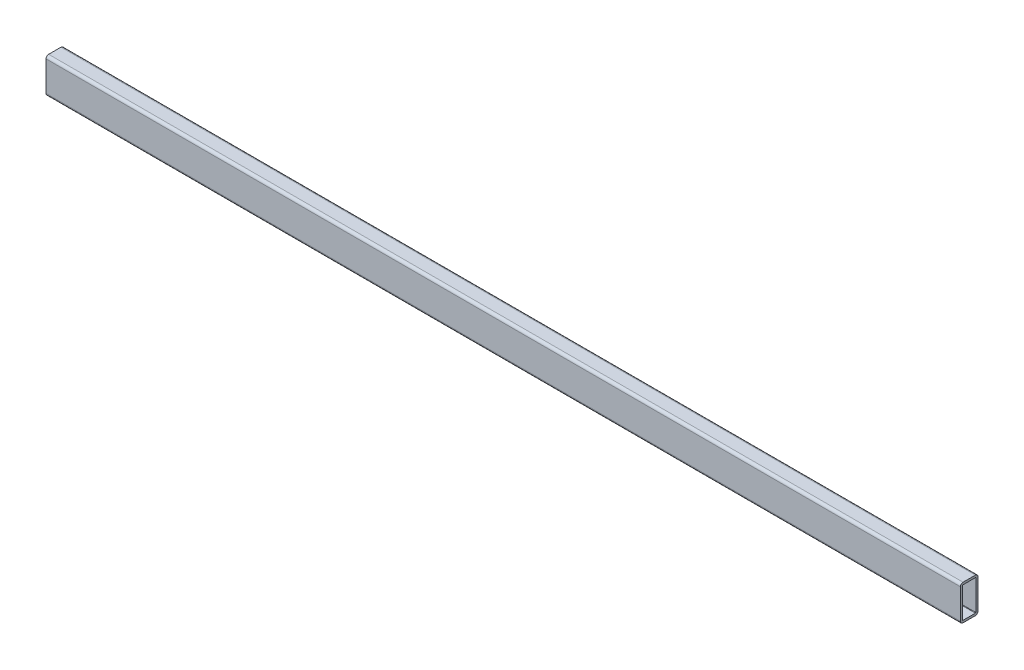
ISO-10303-21;
HEADER;
FILE_DESCRIPTION(('STEP AP214'),'2;1');
FILE_NAME('part.step','',(''),(''),'','','');
FILE_SCHEMA(('AUTOMOTIVE_DESIGN { 1 0 10303 214 1 1 1 1 }'));
ENDSEC;
DATA;
#1=APPLICATION_CONTEXT('core data for automotive mechanical design processes');
#2=APPLICATION_PROTOCOL_DEFINITION('international standard','automotive_design',2000,#1);
#3=PRODUCT_CONTEXT('',#1,'mechanical');
#4=PRODUCT('Part','Part','',(#3));
#5=PRODUCT_RELATED_PRODUCT_CATEGORY('part','',(#4));
#6=PRODUCT_DEFINITION_FORMATION('','',#4);
#7=PRODUCT_DEFINITION_CONTEXT('part definition',#1,'design');
#8=PRODUCT_DEFINITION('design','',#6,#7);
#9=PRODUCT_DEFINITION_SHAPE('','',#8);
#10=(LENGTH_UNIT() NAMED_UNIT(*) SI_UNIT(.MILLI.,.METRE.));
#11=(NAMED_UNIT(*) PLANE_ANGLE_UNIT() SI_UNIT($,.RADIAN.));
#12=(NAMED_UNIT(*) SI_UNIT($,.STERADIAN.) SOLID_ANGLE_UNIT());
#13=UNCERTAINTY_MEASURE_WITH_UNIT(LENGTH_MEASURE(1.E-05),#10,'distance_accuracy_value','');
#14=(GEOMETRIC_REPRESENTATION_CONTEXT(3) GLOBAL_UNCERTAINTY_ASSIGNED_CONTEXT((#13)) GLOBAL_UNIT_ASSIGNED_CONTEXT((#10,
#11,#12)) REPRESENTATION_CONTEXT('',''));
#15=CARTESIAN_POINT('',(0.,0.,0.));
#16=DIRECTION('',(0.,0.,1.));
#17=DIRECTION('',(1.,0.,0.));
#18=AXIS2_PLACEMENT_3D('',#15,#16,#17);
#19=CARTESIAN_POINT('',(2080.,68.0000000000001,-28.0000000000005));
#20=DIRECTION('',(-1.,0.,0.));
#21=DIRECTION('',(0.,0.,1.));
#22=AXIS2_PLACEMENT_3D('',#19,#20,#21);
#23=CYLINDRICAL_SURFACE('',#22,2.00000000000001);
#24=CARTESIAN_POINT('',(-2080.,68.0000000000001,-27.9999999999998));
#25=DIRECTION('',(1.,0.,0.));
#26=DIRECTION('',(0.,0.,1.));
#27=AXIS2_PLACEMENT_3D('',#24,#25,#26);
#28=CIRCLE('',#27,2.00000000000001);
#29=CARTESIAN_POINT('',(-2080.,68.0000000000001,-29.9999999999998));
#30=VERTEX_POINT('',#29);
#31=CARTESIAN_POINT('',(-2080.,70.0000000000001,-27.9999999999998));
#32=VERTEX_POINT('',#31);
#33=EDGE_CURVE('E246',#30,#32,#28,.T.);
#34=ORIENTED_EDGE('',*,*,#33,.F.);
#35=DIRECTION('',(-1.,0.,0.));
#36=VECTOR('',#35,1.);
#37=CARTESIAN_POINT('',(2080.,68.0000000000001,-30.0000000000005));
#38=LINE('',#37,#36);
#39=CARTESIAN_POINT('',(2080.,68.0000000000001,-30.0000000000005));
#40=VERTEX_POINT('',#39);
#41=EDGE_CURVE('E12',#40,#30,#38,.T.);
#42=ORIENTED_EDGE('',*,*,#41,.F.);
#43=CARTESIAN_POINT('',(2080.,68.0000000000001,-28.0000000000005));
#44=DIRECTION('',(1.,0.,0.));
#45=DIRECTION('',(0.,0.,1.));
#46=AXIS2_PLACEMENT_3D('',#43,#44,#45);
#47=CIRCLE('',#46,2.00000000000001);
#48=CARTESIAN_POINT('',(2080.,70.0000000000001,-28.0000000000005));
#49=VERTEX_POINT('',#48);
#50=EDGE_CURVE('E331',#40,#49,#47,.T.);
#51=ORIENTED_EDGE('',*,*,#50,.T.);
#52=DIRECTION('',(-1.,0.,0.));
#53=VECTOR('',#52,1.);
#54=CARTESIAN_POINT('',(2080.,70.0000000000001,-28.0000000000005));
#55=LINE('',#54,#53);
#56=EDGE_CURVE('E93',#49,#32,#55,.T.);
#57=ORIENTED_EDGE('',*,*,#56,.T.);
#58=EDGE_LOOP('',(#34,#42,#51,#57));
#59=FACE_BOUND('',#58,.T.);
#60=ADVANCED_FACE('F74',(#59),#23,.F.);
#61=CARTESIAN_POINT('',(2080.,68.0000000000001,-30.0000000000005));
#62=DIRECTION('',(0.,0.,1.));
#63=DIRECTION('',(0.,-1.,0.));
#64=AXIS2_PLACEMENT_3D('',#61,#62,#63);
#65=PLANE('',#64);
#66=DIRECTION('',(0.,1.,0.));
#67=VECTOR('',#66,1.);
#68=CARTESIAN_POINT('',(-2080.,68.0000000000001,-29.9999999999998));
#69=LINE('',#68,#67);
#70=CARTESIAN_POINT('',(-2080.,-67.9999999999999,-30.0000000000003));
#71=VERTEX_POINT('',#70);
#72=EDGE_CURVE('E248',#71,#30,#69,.T.);
#73=ORIENTED_EDGE('',*,*,#72,.F.);
#74=DIRECTION('',(-1.,0.,0.));
#75=VECTOR('',#74,1.);
#76=CARTESIAN_POINT('',(2080.,-67.9999999999999,-30.000000000001));
#77=LINE('',#76,#75);
#78=CARTESIAN_POINT('',(2080.,-67.9999999999999,-30.000000000001));
#79=VERTEX_POINT('',#78);
#80=EDGE_CURVE('E84',#79,#71,#77,.T.);
#81=ORIENTED_EDGE('',*,*,#80,.F.);
#82=DIRECTION('',(0.,1.,0.));
#83=VECTOR('',#82,1.);
#84=CARTESIAN_POINT('',(2080.,68.0000000000001,-30.0000000000005));
#85=LINE('',#84,#83);
#86=EDGE_CURVE('E333',#79,#40,#85,.T.);
#87=ORIENTED_EDGE('',*,*,#86,.T.);
#88=ORIENTED_EDGE('',*,*,#41,.T.);
#89=EDGE_LOOP('',(#73,#81,#87,#88));
#90=FACE_BOUND('',#89,.T.);
#91=ADVANCED_FACE('F363',(#90),#65,.T.);
#92=CARTESIAN_POINT('',(2080.,-67.9999999999999,-28.000000000001));
#93=DIRECTION('',(-1.,0.,0.));
#94=DIRECTION('',(0.,0.,1.));
#95=AXIS2_PLACEMENT_3D('',#92,#93,#94);
#96=CYLINDRICAL_SURFACE('',#95,2.);
#97=CARTESIAN_POINT('',(-2080.,-67.9999999999999,-28.0000000000003));
#98=DIRECTION('',(1.,0.,0.));
#99=DIRECTION('',(0.,0.,1.));
#100=AXIS2_PLACEMENT_3D('',#97,#98,#99);
#101=CIRCLE('',#100,2.);
#102=CARTESIAN_POINT('',(-2080.,-69.9999999999999,-28.0000000000003));
#103=VERTEX_POINT('',#102);
#104=EDGE_CURVE('E251',#103,#71,#101,.T.);
#105=ORIENTED_EDGE('',*,*,#104,.F.);
#106=DIRECTION('',(-1.,0.,0.));
#107=VECTOR('',#106,1.);
#108=CARTESIAN_POINT('',(2080.,-69.9999999999999,-28.000000000001));
#109=LINE('',#108,#107);
#110=CARTESIAN_POINT('',(2080.,-69.9999999999999,-28.000000000001));
#111=VERTEX_POINT('',#110);
#112=EDGE_CURVE('E277',#111,#103,#109,.T.);
#113=ORIENTED_EDGE('',*,*,#112,.F.);
#114=CARTESIAN_POINT('',(2080.,-67.9999999999999,-28.000000000001));
#115=DIRECTION('',(1.,0.,0.));
#116=DIRECTION('',(0.,0.,1.));
#117=AXIS2_PLACEMENT_3D('',#114,#115,#116);
#118=CIRCLE('',#117,2.);
#119=EDGE_CURVE('E336',#111,#79,#118,.T.);
#120=ORIENTED_EDGE('',*,*,#119,.T.);
#121=ORIENTED_EDGE('',*,*,#80,.T.);
#122=EDGE_LOOP('',(#105,#113,#120,#121));
#123=FACE_BOUND('',#122,.T.);
#124=ADVANCED_FACE('F368',(#123),#96,.F.);
#125=CARTESIAN_POINT('',(2080.,-69.9999999999999,-28.000000000001));
#126=DIRECTION('',(0.,1.,0.));
#127=DIRECTION('',(0.,0.,1.));
#128=AXIS2_PLACEMENT_3D('',#125,#126,#127);
#129=PLANE('',#128);
#130=CARTESIAN_POINT('',(-2070.,-70.,0.140000000002335));
#131=DIRECTION('',(0.,1.,0.));
#132=DIRECTION('',(0.,0.,1.));
#133=AXIS2_PLACEMENT_3D('',#130,#131,#132);
#134=CIRCLE('',#133,4.24999999999986);
#135=CARTESIAN_POINT('',(-2070.,-70.,4.3900000000022));
#136=VERTEX_POINT('',#135);
#137=EDGE_CURVE('E305',#136,#136,#134,.T.);
#138=ORIENTED_EDGE('',*,*,#137,.F.);
#139=EDGE_LOOP('',(#138));
#140=FACE_BOUND('',#139,.T.);
#141=CARTESIAN_POINT('',(-2030.,-70.,0.0600000000012788));
#142=DIRECTION('',(0.,1.,0.));
#143=DIRECTION('',(0.,0.,1.));
#144=AXIS2_PLACEMENT_3D('',#141,#142,#143);
#145=CIRCLE('',#144,4.24999999999986);
#146=CARTESIAN_POINT('',(-2030.,-70.,4.31000000000114));
#147=VERTEX_POINT('',#146);
#148=EDGE_CURVE('E303',#147,#147,#145,.T.);
#149=ORIENTED_EDGE('',*,*,#148,.F.);
#150=EDGE_LOOP('',(#149));
#151=FACE_BOUND('',#150,.T.);
#152=DIRECTION('',(0.,0.,-1.));
#153=VECTOR('',#152,1.);
#154=CARTESIAN_POINT('',(-2080.,-69.9999999999999,-28.0000000000003));
#155=LINE('',#154,#153);
#156=CARTESIAN_POINT('',(-2080.,-70.0000000000001,27.9999999999998));
#157=VERTEX_POINT('',#156);
#158=EDGE_CURVE('E254',#157,#103,#155,.T.);
#159=ORIENTED_EDGE('',*,*,#158,.F.);
#160=DIRECTION('',(-1.,0.,0.));
#161=VECTOR('',#160,1.);
#162=CARTESIAN_POINT('',(2080.,-70.0000000000001,27.999999999999));
#163=LINE('',#162,#161);
#164=CARTESIAN_POINT('',(2080.,-70.0000000000001,27.999999999999));
#165=VERTEX_POINT('',#164);
#166=EDGE_CURVE('E274',#165,#157,#163,.T.);
#167=ORIENTED_EDGE('',*,*,#166,.F.);
#168=DIRECTION('',(0.,0.,-1.));
#169=VECTOR('',#168,1.);
#170=CARTESIAN_POINT('',(2080.,-69.9999999999999,-28.000000000001));
#171=LINE('',#170,#169);
#172=EDGE_CURVE('E339',#165,#111,#171,.T.);
#173=ORIENTED_EDGE('',*,*,#172,.T.);
#174=ORIENTED_EDGE('',*,*,#112,.T.);
#175=EDGE_LOOP('',(#159,#167,#173,#174));
#176=FACE_BOUND('',#175,.T.);
#177=ADVANCED_FACE('F570',(#140,#151,#176),#129,.T.);
#178=CARTESIAN_POINT('',(2080.,-68.0000000000001,27.999999999999));
#179=DIRECTION('',(-1.,0.,0.));
#180=DIRECTION('',(0.,0.,1.));
#181=AXIS2_PLACEMENT_3D('',#178,#179,#180);
#182=CYLINDRICAL_SURFACE('',#181,2.);
#183=CARTESIAN_POINT('',(-2080.,-68.0000000000001,27.9999999999998));
#184=DIRECTION('',(1.,0.,0.));
#185=DIRECTION('',(0.,0.,1.));
#186=AXIS2_PLACEMENT_3D('',#183,#184,#185);
#187=CIRCLE('',#186,2.);
#188=CARTESIAN_POINT('',(-2080.,-68.0000000000001,29.9999999999998));
#189=VERTEX_POINT('',#188);
#190=EDGE_CURVE('E257',#189,#157,#187,.T.);
#191=ORIENTED_EDGE('',*,*,#190,.F.);
#192=DIRECTION('',(-1.,0.,0.));
#193=VECTOR('',#192,1.);
#194=CARTESIAN_POINT('',(2080.,-68.0000000000001,29.999999999999));
#195=LINE('',#194,#193);
#196=CARTESIAN_POINT('',(2080.,-68.0000000000001,29.999999999999));
#197=VERTEX_POINT('',#196);
#198=EDGE_CURVE('E204',#197,#189,#195,.T.);
#199=ORIENTED_EDGE('',*,*,#198,.F.);
#200=CARTESIAN_POINT('',(2080.,-68.0000000000001,27.999999999999));
#201=DIRECTION('',(1.,0.,0.));
#202=DIRECTION('',(0.,0.,1.));
#203=AXIS2_PLACEMENT_3D('',#200,#201,#202);
#204=CIRCLE('',#203,2.);
#205=EDGE_CURVE('E215',#197,#165,#204,.T.);
#206=ORIENTED_EDGE('',*,*,#205,.T.);
#207=ORIENTED_EDGE('',*,*,#166,.T.);
#208=EDGE_LOOP('',(#191,#199,#206,#207));
#209=FACE_BOUND('',#208,.T.);
#210=ADVANCED_FACE('F343',(#209),#182,.F.);
#211=CARTESIAN_POINT('',(2080.,67.9999999999999,29.9999999999995));
#212=DIRECTION('',(0.,0.,-1.));
#213=DIRECTION('',(0.,1.,0.));
#214=AXIS2_PLACEMENT_3D('',#211,#212,#213);
#215=PLANE('',#214);
#216=DIRECTION('',(0.,-1.,0.));
#217=VECTOR('',#216,1.);
#218=CARTESIAN_POINT('',(-2080.,67.9999999999999,30.0000000000003));
#219=LINE('',#218,#217);
#220=CARTESIAN_POINT('',(-2080.,67.9999999999999,30.0000000000003));
#221=VERTEX_POINT('',#220);
#222=EDGE_CURVE('E200',#221,#189,#219,.T.);
#223=ORIENTED_EDGE('',*,*,#222,.F.);
#224=DIRECTION('',(-1.,0.,0.));
#225=VECTOR('',#224,1.);
#226=CARTESIAN_POINT('',(2080.,67.9999999999999,29.9999999999995));
#227=LINE('',#226,#225);
#228=CARTESIAN_POINT('',(2080.,67.9999999999999,29.9999999999995));
#229=VERTEX_POINT('',#228);
#230=EDGE_CURVE('E195',#229,#221,#227,.T.);
#231=ORIENTED_EDGE('',*,*,#230,.F.);
#232=DIRECTION('',(0.,-1.,0.));
#233=VECTOR('',#232,1.);
#234=CARTESIAN_POINT('',(2080.,67.9999999999999,29.9999999999995));
#235=LINE('',#234,#233);
#236=EDGE_CURVE('E198',#229,#197,#235,.T.);
#237=ORIENTED_EDGE('',*,*,#236,.T.);
#238=ORIENTED_EDGE('',*,*,#198,.T.);
#239=EDGE_LOOP('',(#223,#231,#237,#238));
#240=FACE_BOUND('',#239,.T.);
#241=ADVANCED_FACE('F197',(#240),#215,.T.);
#242=CARTESIAN_POINT('',(2080.,67.9999999999999,27.9999999999995));
#243=DIRECTION('',(-1.,0.,0.));
#244=DIRECTION('',(0.,0.,1.));
#245=AXIS2_PLACEMENT_3D('',#242,#243,#244);
#246=CYLINDRICAL_SURFACE('',#245,2.00000000000001);
#247=CARTESIAN_POINT('',(-2080.,67.9999999999999,28.0000000000003));
#248=DIRECTION('',(1.,0.,0.));
#249=DIRECTION('',(0.,0.,1.));
#250=AXIS2_PLACEMENT_3D('',#247,#248,#249);
#251=CIRCLE('',#250,2.00000000000001);
#252=CARTESIAN_POINT('',(-2080.,69.9999999999999,28.0000000000003));
#253=VERTEX_POINT('',#252);
#254=EDGE_CURVE('E262',#253,#221,#251,.T.);
#255=ORIENTED_EDGE('',*,*,#254,.F.);
#256=DIRECTION('',(-1.,0.,0.));
#257=VECTOR('',#256,1.);
#258=CARTESIAN_POINT('',(2080.,69.9999999999999,27.9999999999995));
#259=LINE('',#258,#257);
#260=CARTESIAN_POINT('',(2080.,69.9999999999999,27.9999999999995));
#261=VERTEX_POINT('',#260);
#262=EDGE_CURVE('E142',#261,#253,#259,.T.);
#263=ORIENTED_EDGE('',*,*,#262,.F.);
#264=CARTESIAN_POINT('',(2080.,67.9999999999999,27.9999999999995));
#265=DIRECTION('',(1.,0.,0.));
#266=DIRECTION('',(0.,0.,1.));
#267=AXIS2_PLACEMENT_3D('',#264,#265,#266);
#268=CIRCLE('',#267,2.00000000000001);
#269=EDGE_CURVE('E212',#261,#229,#268,.T.);
#270=ORIENTED_EDGE('',*,*,#269,.T.);
#271=ORIENTED_EDGE('',*,*,#230,.T.);
#272=EDGE_LOOP('',(#255,#263,#270,#271));
#273=FACE_BOUND('',#272,.T.);
#274=ADVANCED_FACE('F218',(#273),#246,.F.);
#275=CARTESIAN_POINT('',(2080.,-68.0000000000001,27.999999999999));
#276=DIRECTION('',(-1.,0.,0.));
#277=DIRECTION('',(0.,0.,1.));
#278=AXIS2_PLACEMENT_3D('',#275,#276,#277);
#279=CYLINDRICAL_SURFACE('',#278,12.);
#280=CARTESIAN_POINT('',(-2080.,-68.0000000000001,27.9999999999998));
#281=DIRECTION('',(1.,0.,0.));
#282=DIRECTION('',(0.,0.,1.));
#283=AXIS2_PLACEMENT_3D('',#280,#281,#282);
#284=CIRCLE('',#283,12.);
#285=CARTESIAN_POINT('',(-2080.,-68.0000000000001,39.9999999999998));
#286=VERTEX_POINT('',#285);
#287=CARTESIAN_POINT('',(-2080.,-80.0000000000001,27.9999999999997));
#288=VERTEX_POINT('',#287);
#289=EDGE_CURVE('E225',#286,#288,#284,.T.);
#290=ORIENTED_EDGE('',*,*,#289,.T.);
#291=DIRECTION('',(-1.,0.,0.));
#292=VECTOR('',#291,1.);
#293=CARTESIAN_POINT('',(2080.,-80.0000000000001,27.999999999999));
#294=LINE('',#293,#292);
#295=CARTESIAN_POINT('',(2080.,-80.0000000000001,27.999999999999));
#296=VERTEX_POINT('',#295);
#297=EDGE_CURVE('E270',#296,#288,#294,.T.);
#298=ORIENTED_EDGE('',*,*,#297,.F.);
#299=CARTESIAN_POINT('',(2080.,-68.0000000000001,27.999999999999));
#300=DIRECTION('',(1.,0.,0.));
#301=DIRECTION('',(0.,0.,1.));
#302=AXIS2_PLACEMENT_3D('',#299,#300,#301);
#303=CIRCLE('',#302,12.);
#304=CARTESIAN_POINT('',(2080.,-68.0000000000001,39.999999999999));
#305=VERTEX_POINT('',#304);
#306=EDGE_CURVE('E267',#305,#296,#303,.T.);
#307=ORIENTED_EDGE('',*,*,#306,.F.);
#308=DIRECTION('',(-1.,0.,0.));
#309=VECTOR('',#308,1.);
#310=CARTESIAN_POINT('',(2080.,-68.0000000000001,39.999999999999));
#311=LINE('',#310,#309);
#312=EDGE_CURVE('E221',#305,#286,#311,.T.);
#313=ORIENTED_EDGE('',*,*,#312,.T.);
#314=EDGE_LOOP('',(#290,#298,#307,#313));
#315=FACE_BOUND('',#314,.T.);
#316=ADVANCED_FACE('F76',(#315),#279,.T.);
#317=CARTESIAN_POINT('',(2080.,-79.9999999999999,-28.0000000000011));
#318=DIRECTION('',(0.,1.,0.));
#319=DIRECTION('',(0.,0.,1.));
#320=AXIS2_PLACEMENT_3D('',#317,#318,#319);
#321=PLANE('',#320);
#322=CARTESIAN_POINT('',(-2070.,-80.,0.140000000002335));
#323=DIRECTION('',(0.,1.,0.));
#324=DIRECTION('',(0.,0.,1.));
#325=AXIS2_PLACEMENT_3D('',#322,#323,#324);
#326=CIRCLE('',#325,4.24999999999986);
#327=CARTESIAN_POINT('',(-2070.,-80.,4.3900000000022));
#328=VERTEX_POINT('',#327);
#329=EDGE_CURVE('E78',#328,#328,#326,.T.);
#330=ORIENTED_EDGE('',*,*,#329,.T.);
#331=EDGE_LOOP('',(#330));
#332=FACE_BOUND('',#331,.T.);
#333=CARTESIAN_POINT('',(-2030.,-80.,0.0600000000012788));
#334=DIRECTION('',(0.,1.,0.));
#335=DIRECTION('',(0.,0.,1.));
#336=AXIS2_PLACEMENT_3D('',#333,#334,#335);
#337=CIRCLE('',#336,4.24999999999986);
#338=CARTESIAN_POINT('',(-2030.,-80.,4.31000000000114));
#339=VERTEX_POINT('',#338);
#340=EDGE_CURVE('E229',#339,#339,#337,.T.);
#341=ORIENTED_EDGE('',*,*,#340,.T.);
#342=EDGE_LOOP('',(#341));
#343=FACE_BOUND('',#342,.T.);
#344=DIRECTION('',(0.,0.,-1.));
#345=VECTOR('',#344,1.);
#346=CARTESIAN_POINT('',(-2080.,-79.9999999999999,-28.0000000000003));
#347=LINE('',#346,#345);
#348=CARTESIAN_POINT('',(-2080.,-79.9999999999999,-28.0000000000003));
#349=VERTEX_POINT('',#348);
#350=EDGE_CURVE('E228',#288,#349,#347,.T.);
#351=ORIENTED_EDGE('',*,*,#350,.T.);
#352=DIRECTION('',(-1.,0.,0.));
#353=VECTOR('',#352,1.);
#354=CARTESIAN_POINT('',(2080.,-79.9999999999999,-28.0000000000011));
#355=LINE('',#354,#353);
#356=CARTESIAN_POINT('',(2080.,-79.9999999999999,-28.0000000000011));
#357=VERTEX_POINT('',#356);
#358=EDGE_CURVE('E299',#357,#349,#355,.T.);
#359=ORIENTED_EDGE('',*,*,#358,.F.);
#360=DIRECTION('',(0.,0.,-1.));
#361=VECTOR('',#360,1.);
#362=CARTESIAN_POINT('',(2080.,-79.9999999999999,-28.0000000000011));
#363=LINE('',#362,#361);
#364=EDGE_CURVE('E155',#296,#357,#363,.T.);
#365=ORIENTED_EDGE('',*,*,#364,.F.);
#366=ORIENTED_EDGE('',*,*,#297,.T.);
#367=EDGE_LOOP('',(#351,#359,#365,#366));
#368=FACE_BOUND('',#367,.T.);
#369=ADVANCED_FACE('F390',(#332,#343,#368),#321,.F.);
#370=CARTESIAN_POINT('',(2080.,-67.9999999999999,-28.000000000001));
#371=DIRECTION('',(-1.,0.,0.));
#372=DIRECTION('',(0.,0.,1.));
#373=AXIS2_PLACEMENT_3D('',#370,#371,#372);
#374=CYLINDRICAL_SURFACE('',#373,12.);
#375=CARTESIAN_POINT('',(-2080.,-67.9999999999999,-28.0000000000003));
#376=DIRECTION('',(1.,0.,0.));
#377=DIRECTION('',(0.,0.,1.));
#378=AXIS2_PLACEMENT_3D('',#375,#376,#377);
#379=CIRCLE('',#378,12.);
#380=CARTESIAN_POINT('',(-2080.,-67.9999999999999,-40.0000000000003));
#381=VERTEX_POINT('',#380);
#382=EDGE_CURVE('E232',#349,#381,#379,.T.);
#383=ORIENTED_EDGE('',*,*,#382,.T.);
#384=DIRECTION('',(-1.,0.,0.));
#385=VECTOR('',#384,1.);
#386=CARTESIAN_POINT('',(2080.,-67.9999999999999,-40.000000000001));
#387=LINE('',#386,#385);
#388=CARTESIAN_POINT('',(2080.,-67.9999999999999,-40.000000000001));
#389=VERTEX_POINT('',#388);
#390=EDGE_CURVE('E296',#389,#381,#387,.T.);
#391=ORIENTED_EDGE('',*,*,#390,.F.);
#392=CARTESIAN_POINT('',(2080.,-67.9999999999999,-28.000000000001));
#393=DIRECTION('',(1.,0.,0.));
#394=DIRECTION('',(0.,0.,1.));
#395=AXIS2_PLACEMENT_3D('',#392,#393,#394);
#396=CIRCLE('',#395,12.);
#397=EDGE_CURVE('E319',#357,#389,#396,.T.);
#398=ORIENTED_EDGE('',*,*,#397,.F.);
#399=ORIENTED_EDGE('',*,*,#358,.T.);
#400=EDGE_LOOP('',(#383,#391,#398,#399));
#401=FACE_BOUND('',#400,.T.);
#402=ADVANCED_FACE('F387',(#401),#374,.T.);
#403=CARTESIAN_POINT('',(2080.,68.0000000000002,-40.0000000000005));
#404=DIRECTION('',(0.,0.,1.));
#405=DIRECTION('',(0.,-1.,0.));
#406=AXIS2_PLACEMENT_3D('',#403,#404,#405);
#407=PLANE('',#406);
#408=DIRECTION('',(0.,1.,0.));
#409=VECTOR('',#408,1.);
#410=CARTESIAN_POINT('',(-2080.,68.0000000000002,-39.9999999999998));
#411=LINE('',#410,#409);
#412=CARTESIAN_POINT('',(-2080.,68.0000000000002,-39.9999999999998));
#413=VERTEX_POINT('',#412);
#414=EDGE_CURVE('E234',#381,#413,#411,.T.);
#415=ORIENTED_EDGE('',*,*,#414,.T.);
#416=DIRECTION('',(-1.,0.,0.));
#417=VECTOR('',#416,1.);
#418=CARTESIAN_POINT('',(2080.,68.0000000000002,-40.0000000000005));
#419=LINE('',#418,#417);
#420=CARTESIAN_POINT('',(2080.,68.0000000000002,-40.0000000000005));
#421=VERTEX_POINT('',#420);
#422=EDGE_CURVE('E293',#421,#413,#419,.T.);
#423=ORIENTED_EDGE('',*,*,#422,.F.);
#424=DIRECTION('',(0.,1.,0.));
#425=VECTOR('',#424,1.);
#426=CARTESIAN_POINT('',(2080.,68.0000000000002,-40.0000000000005));
#427=LINE('',#426,#425);
#428=EDGE_CURVE('E321',#389,#421,#427,.T.);
#429=ORIENTED_EDGE('',*,*,#428,.F.);
#430=ORIENTED_EDGE('',*,*,#390,.T.);
#431=EDGE_LOOP('',(#415,#423,#429,#430));
#432=FACE_BOUND('',#431,.T.);
#433=ADVANCED_FACE('F383',(#432),#407,.F.);
#434=CARTESIAN_POINT('',(2080.,68.0000000000001,-28.0000000000005));
#435=DIRECTION('',(-1.,0.,0.));
#436=DIRECTION('',(0.,0.,1.));
#437=AXIS2_PLACEMENT_3D('',#434,#435,#436);
#438=CYLINDRICAL_SURFACE('',#437,12.);
#439=CARTESIAN_POINT('',(-2080.,68.0000000000001,-27.9999999999998));
#440=DIRECTION('',(1.,0.,0.));
#441=DIRECTION('',(0.,0.,1.));
#442=AXIS2_PLACEMENT_3D('',#439,#440,#441);
#443=CIRCLE('',#442,12.);
#444=CARTESIAN_POINT('',(-2080.,80.0000000000001,-27.9999999999997));
#445=VERTEX_POINT('',#444);
#446=EDGE_CURVE('E236',#413,#445,#443,.T.);
#447=ORIENTED_EDGE('',*,*,#446,.T.);
#448=DIRECTION('',(-1.,0.,0.));
#449=VECTOR('',#448,1.);
#450=CARTESIAN_POINT('',(2080.,80.0000000000001,-28.0000000000005));
#451=LINE('',#450,#449);
#452=CARTESIAN_POINT('',(2080.,80.0000000000001,-28.0000000000005));
#453=VERTEX_POINT('',#452);
#454=EDGE_CURVE('E290',#453,#445,#451,.T.);
#455=ORIENTED_EDGE('',*,*,#454,.F.);
#456=CARTESIAN_POINT('',(2080.,68.0000000000001,-28.0000000000005));
#457=DIRECTION('',(1.,0.,0.));
#458=DIRECTION('',(0.,0.,1.));
#459=AXIS2_PLACEMENT_3D('',#456,#457,#458);
#460=CIRCLE('',#459,12.);
#461=EDGE_CURVE('E323',#421,#453,#460,.T.);
#462=ORIENTED_EDGE('',*,*,#461,.F.);
#463=ORIENTED_EDGE('',*,*,#422,.T.);
#464=EDGE_LOOP('',(#447,#455,#462,#463));
#465=FACE_BOUND('',#464,.T.);
#466=ADVANCED_FACE('F379',(#465),#438,.T.);
#467=CARTESIAN_POINT('',(2080.,80.0000000000001,-28.0000000000005));
#468=DIRECTION('',(0.,-1.,0.));
#469=DIRECTION('',(0.,0.,-1.));
#470=AXIS2_PLACEMENT_3D('',#467,#468,#469);
#471=PLANE('',#470);
#472=DIRECTION('',(0.,0.,1.));
#473=VECTOR('',#472,1.);
#474=CARTESIAN_POINT('',(-2080.,80.0000000000001,-27.9999999999997));
#475=LINE('',#474,#473);
#476=CARTESIAN_POINT('',(-2080.,79.9999999999999,28.0000000000003));
#477=VERTEX_POINT('',#476);
#478=EDGE_CURVE('E238',#445,#477,#475,.T.);
#479=ORIENTED_EDGE('',*,*,#478,.T.);
#480=DIRECTION('',(-1.,0.,0.));
#481=VECTOR('',#480,1.);
#482=CARTESIAN_POINT('',(2080.,79.9999999999999,27.9999999999995));
#483=LINE('',#482,#481);
#484=CARTESIAN_POINT('',(2080.,79.9999999999999,27.9999999999995));
#485=VERTEX_POINT('',#484);
#486=EDGE_CURVE('E287',#485,#477,#483,.T.);
#487=ORIENTED_EDGE('',*,*,#486,.F.);
#488=DIRECTION('',(0.,0.,1.));
#489=VECTOR('',#488,1.);
#490=CARTESIAN_POINT('',(2080.,80.0000000000001,-28.0000000000005));
#491=LINE('',#490,#489);
#492=EDGE_CURVE('E325',#453,#485,#491,.T.);
#493=ORIENTED_EDGE('',*,*,#492,.F.);
#494=ORIENTED_EDGE('',*,*,#454,.T.);
#495=EDGE_LOOP('',(#479,#487,#493,#494));
#496=FACE_BOUND('',#495,.T.);
#497=ADVANCED_FACE('F375',(#496),#471,.F.);
#498=CARTESIAN_POINT('',(2080.,67.9999999999999,27.9999999999995));
#499=DIRECTION('',(-1.,0.,0.));
#500=DIRECTION('',(0.,0.,1.));
#501=AXIS2_PLACEMENT_3D('',#498,#499,#500);
#502=CYLINDRICAL_SURFACE('',#501,12.);
#503=CARTESIAN_POINT('',(-2080.,67.9999999999999,28.0000000000003));
#504=DIRECTION('',(1.,0.,0.));
#505=DIRECTION('',(0.,0.,1.));
#506=AXIS2_PLACEMENT_3D('',#503,#504,#505);
#507=CIRCLE('',#506,12.);
#508=CARTESIAN_POINT('',(-2080.,67.9999999999999,40.0000000000003));
#509=VERTEX_POINT('',#508);
#510=EDGE_CURVE('E241',#477,#509,#507,.T.);
#511=ORIENTED_EDGE('',*,*,#510,.T.);
#512=DIRECTION('',(-1.,0.,0.));
#513=VECTOR('',#512,1.);
#514=CARTESIAN_POINT('',(2080.,67.9999999999999,39.9999999999995));
#515=LINE('',#514,#513);
#516=CARTESIAN_POINT('',(2080.,67.9999999999999,39.9999999999995));
#517=VERTEX_POINT('',#516);
#518=EDGE_CURVE('E283',#517,#509,#515,.T.);
#519=ORIENTED_EDGE('',*,*,#518,.F.);
#520=CARTESIAN_POINT('',(2080.,67.9999999999999,27.9999999999995));
#521=DIRECTION('',(1.,0.,0.));
#522=DIRECTION('',(0.,0.,1.));
#523=AXIS2_PLACEMENT_3D('',#520,#521,#522);
#524=CIRCLE('',#523,12.);
#525=EDGE_CURVE('E327',#485,#517,#524,.T.);
#526=ORIENTED_EDGE('',*,*,#525,.F.);
#527=ORIENTED_EDGE('',*,*,#486,.T.);
#528=EDGE_LOOP('',(#511,#519,#526,#527));
#529=FACE_BOUND('',#528,.T.);
#530=ADVANCED_FACE('F357',(#529),#502,.T.);
#531=CARTESIAN_POINT('',(2080.,67.9999999999999,39.9999999999995));
#532=DIRECTION('',(0.,0.,-1.));
#533=DIRECTION('',(0.,1.,0.));
#534=AXIS2_PLACEMENT_3D('',#531,#532,#533);
#535=PLANE('',#534);
#536=DIRECTION('',(0.,-1.,0.));
#537=VECTOR('',#536,1.);
#538=CARTESIAN_POINT('',(-2080.,67.9999999999999,40.0000000000002));
#539=LINE('',#538,#537);
#540=EDGE_CURVE('E243',#509,#286,#539,.T.);
#541=ORIENTED_EDGE('',*,*,#540,.T.);
#542=ORIENTED_EDGE('',*,*,#312,.F.);
#543=DIRECTION('',(0.,-1.,0.));
#544=VECTOR('',#543,1.);
#545=CARTESIAN_POINT('',(2080.,67.9999999999999,39.9999999999995));
#546=LINE('',#545,#544);
#547=EDGE_CURVE('E329',#517,#305,#546,.T.);
#548=ORIENTED_EDGE('',*,*,#547,.F.);
#549=ORIENTED_EDGE('',*,*,#518,.T.);
#550=EDGE_LOOP('',(#541,#542,#548,#549));
#551=FACE_BOUND('',#550,.T.);
#552=ADVANCED_FACE('F349',(#551),#535,.F.);
#553=CARTESIAN_POINT('',(2080.,70.0000000000001,-28.0000000000005));
#554=DIRECTION('',(0.,-1.,0.));
#555=DIRECTION('',(0.,0.,-1.));
#556=AXIS2_PLACEMENT_3D('',#553,#554,#555);
#557=PLANE('',#556);
#558=DIRECTION('',(0.,0.,1.));
#559=VECTOR('',#558,1.);
#560=CARTESIAN_POINT('',(-2080.,70.0000000000001,-27.9999999999998));
#561=LINE('',#560,#559);
#562=EDGE_CURVE('E264',#32,#253,#561,.T.);
#563=ORIENTED_EDGE('',*,*,#562,.F.);
#564=ORIENTED_EDGE('',*,*,#56,.F.);
#565=DIRECTION('',(0.,0.,1.));
#566=VECTOR('',#565,1.);
#567=CARTESIAN_POINT('',(2080.,70.0000000000001,-28.0000000000005));
#568=LINE('',#567,#566);
#569=EDGE_CURVE('E219',#49,#261,#568,.T.);
#570=ORIENTED_EDGE('',*,*,#569,.T.);
#571=ORIENTED_EDGE('',*,*,#262,.T.);
#572=EDGE_LOOP('',(#563,#564,#570,#571));
#573=FACE_BOUND('',#572,.T.);
#574=ADVANCED_FACE('F347',(#573),#557,.T.);
#575=CARTESIAN_POINT('',(2080.,-68.0000000000001,27.999999999999));
#576=DIRECTION('',(-1.,0.,0.));
#577=DIRECTION('',(0.,0.,1.));
#578=AXIS2_PLACEMENT_3D('',#575,#576,#577);
#579=PLANE('',#578);
#580=ORIENTED_EDGE('',*,*,#306,.T.);
#581=ORIENTED_EDGE('',*,*,#364,.T.);
#582=ORIENTED_EDGE('',*,*,#397,.T.);
#583=ORIENTED_EDGE('',*,*,#428,.T.);
#584=ORIENTED_EDGE('',*,*,#461,.T.);
#585=ORIENTED_EDGE('',*,*,#492,.T.);
#586=ORIENTED_EDGE('',*,*,#525,.T.);
#587=ORIENTED_EDGE('',*,*,#547,.T.);
#588=EDGE_LOOP('',(#580,#581,#582,#583,#584,#585,#586,#587));
#589=FACE_BOUND('',#588,.T.);
#590=ORIENTED_EDGE('',*,*,#50,.F.);
#591=ORIENTED_EDGE('',*,*,#86,.F.);
#592=ORIENTED_EDGE('',*,*,#119,.F.);
#593=ORIENTED_EDGE('',*,*,#172,.F.);
#594=ORIENTED_EDGE('',*,*,#205,.F.);
#595=ORIENTED_EDGE('',*,*,#236,.F.);
#596=ORIENTED_EDGE('',*,*,#269,.F.);
#597=ORIENTED_EDGE('',*,*,#569,.F.);
#598=EDGE_LOOP('',(#590,#591,#592,#593,#594,#595,#596,#597));
#599=FACE_BOUND('',#598,.T.);
#600=ADVANCED_FACE('F210',(#589,#599),#579,.F.);
#601=CARTESIAN_POINT('',(-2080.,-68.0000000000001,27.9999999999998));
#602=DIRECTION('',(-1.,0.,0.));
#603=DIRECTION('',(0.,0.,1.));
#604=AXIS2_PLACEMENT_3D('',#601,#602,#603);
#605=PLANE('',#604);
#606=ORIENTED_EDGE('',*,*,#289,.F.);
#607=ORIENTED_EDGE('',*,*,#540,.F.);
#608=ORIENTED_EDGE('',*,*,#510,.F.);
#609=ORIENTED_EDGE('',*,*,#478,.F.);
#610=ORIENTED_EDGE('',*,*,#446,.F.);
#611=ORIENTED_EDGE('',*,*,#414,.F.);
#612=ORIENTED_EDGE('',*,*,#382,.F.);
#613=ORIENTED_EDGE('',*,*,#350,.F.);
#614=EDGE_LOOP('',(#606,#607,#608,#609,#610,#611,#612,#613));
#615=FACE_BOUND('',#614,.T.);
#616=ORIENTED_EDGE('',*,*,#33,.T.);
#617=ORIENTED_EDGE('',*,*,#562,.T.);
#618=ORIENTED_EDGE('',*,*,#254,.T.);
#619=ORIENTED_EDGE('',*,*,#222,.T.);
#620=ORIENTED_EDGE('',*,*,#190,.T.);
#621=ORIENTED_EDGE('',*,*,#158,.T.);
#622=ORIENTED_EDGE('',*,*,#104,.T.);
#623=ORIENTED_EDGE('',*,*,#72,.T.);
#624=EDGE_LOOP('',(#616,#617,#618,#619,#620,#621,#622,#623));
#625=FACE_BOUND('',#624,.T.);
#626=ADVANCED_FACE('F346',(#615,#625),#605,.T.);
#627=CARTESIAN_POINT('',(-2030.,-89.4999999999853,0.0600000000012788));
#628=DIRECTION('',(0.,-1.,0.));
#629=DIRECTION('',(0.,0.,-1.));
#630=AXIS2_PLACEMENT_3D('',#627,#628,#629);
#631=CYLINDRICAL_SURFACE('',#630,4.24999999999986);
#632=ORIENTED_EDGE('',*,*,#148,.T.);
#633=EDGE_LOOP('',(#632));
#634=FACE_BOUND('',#633,.T.);
#635=ORIENTED_EDGE('',*,*,#340,.F.);
#636=EDGE_LOOP('',(#635));
#637=FACE_BOUND('',#636,.T.);
#638=ADVANCED_FACE('F426',(#634,#637),#631,.F.);
#639=CARTESIAN_POINT('',(-2070.,-89.499999999985,0.140000000002335));
#640=DIRECTION('',(0.,-1.,0.));
#641=DIRECTION('',(0.,0.,-1.));
#642=AXIS2_PLACEMENT_3D('',#639,#640,#641);
#643=CYLINDRICAL_SURFACE('',#642,4.24999999999986);
#644=ORIENTED_EDGE('',*,*,#137,.T.);
#645=EDGE_LOOP('',(#644));
#646=FACE_BOUND('',#645,.T.);
#647=ORIENTED_EDGE('',*,*,#329,.F.);
#648=EDGE_LOOP('',(#647));
#649=FACE_BOUND('',#648,.T.);
#650=ADVANCED_FACE('F430',(#646,#649),#643,.F.);
#651=CLOSED_SHELL('',(#60,#91,#124,#177,#210,#241,#274,#316,#369,#402,#433,#466,#497,#530,#552,
#574,#600,#626,#638,#650));
#652=MANIFOLD_SOLID_BREP('B2',#651);
#653=ADVANCED_BREP_SHAPE_REPRESENTATION('',(#18,#652),#14);
#654=SHAPE_DEFINITION_REPRESENTATION(#9,#653);
ENDSEC;
END-ISO-10303-21;
